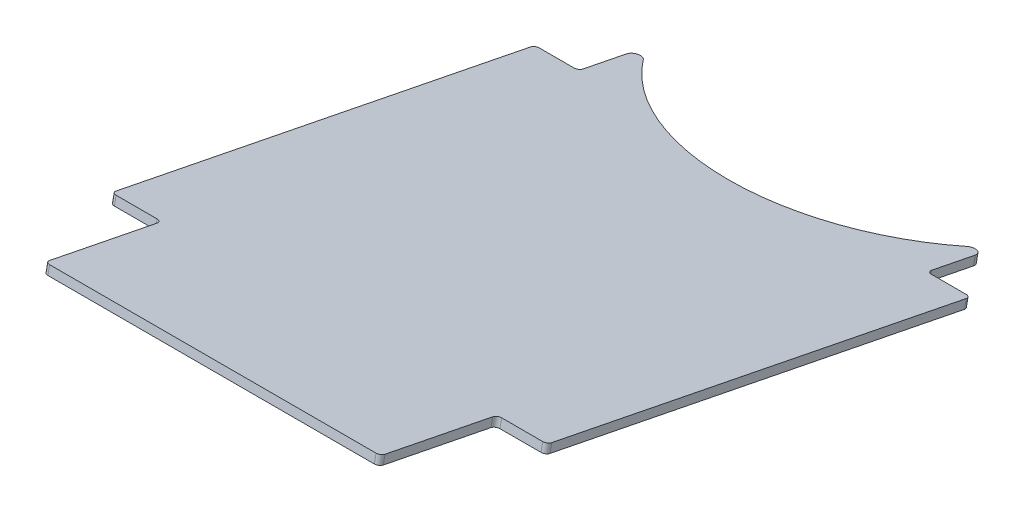
ISO-10303-21;
HEADER;
FILE_DESCRIPTION(('STEP AP214'),'2;1');
FILE_NAME('part.step','',(''),(''),'','','');
FILE_SCHEMA(('AUTOMOTIVE_DESIGN { 1 0 10303 214 1 1 1 1 }'));
ENDSEC;
DATA;
#1=APPLICATION_CONTEXT('core data for automotive mechanical design processes');
#2=APPLICATION_PROTOCOL_DEFINITION('international standard','automotive_design',2000,#1);
#3=PRODUCT_CONTEXT('',#1,'mechanical');
#4=PRODUCT('Part','Part','',(#3));
#5=PRODUCT_RELATED_PRODUCT_CATEGORY('part','',(#4));
#6=PRODUCT_DEFINITION_FORMATION('','',#4);
#7=PRODUCT_DEFINITION_CONTEXT('part definition',#1,'design');
#8=PRODUCT_DEFINITION('design','',#6,#7);
#9=PRODUCT_DEFINITION_SHAPE('','',#8);
#10=(LENGTH_UNIT() NAMED_UNIT(*) SI_UNIT(.MILLI.,.METRE.));
#11=(NAMED_UNIT(*) PLANE_ANGLE_UNIT() SI_UNIT($,.RADIAN.));
#12=(NAMED_UNIT(*) SI_UNIT($,.STERADIAN.) SOLID_ANGLE_UNIT());
#13=UNCERTAINTY_MEASURE_WITH_UNIT(LENGTH_MEASURE(1.E-05),#10,'distance_accuracy_value','');
#14=(GEOMETRIC_REPRESENTATION_CONTEXT(3) GLOBAL_UNCERTAINTY_ASSIGNED_CONTEXT((#13)) GLOBAL_UNIT_ASSIGNED_CONTEXT((#10,
#11,#12)) REPRESENTATION_CONTEXT('',''));
#15=CARTESIAN_POINT('',(0.,0.,0.));
#16=DIRECTION('',(0.,0.,1.));
#17=DIRECTION('',(1.,0.,0.));
#18=AXIS2_PLACEMENT_3D('',#15,#16,#17);
#19=CARTESIAN_POINT('',(317.5,38.1,0.));
#20=DIRECTION('',(0.,-0.980785280403232,0.195090322016121));
#21=DIRECTION('',(0.,-0.195090322016121,-0.980785280403232));
#22=AXIS2_PLACEMENT_3D('',#19,#20,#21);
#23=PLANE('',#22);
#24=DIRECTION('',(1.,0.,0.));
#25=VECTOR('',#24,1.);
#26=CARTESIAN_POINT('',(31.75,51.896948909235,69.3619461222421));
#27=LINE('',#26,#25);
#28=CARTESIAN_POINT('',(3.302,51.896948909235,69.3619461222421));
#29=VERTEX_POINT('',#28);
#30=CARTESIAN_POINT('',(28.448,51.896948909235,69.3619461222421));
#31=VERTEX_POINT('',#30);
#32=EDGE_CURVE('E355',#29,#31,#27,.T.);
#33=ORIENTED_EDGE('',*,*,#32,.F.);
#34=CARTESIAN_POINT('',(3.302,52.5411371525322,72.6004991181335));
#35=DIRECTION('',(0.,-0.980785280403232,0.195090322016121));
#36=DIRECTION('',(0.,-0.195090322016121,-0.980785280403232));
#37=AXIS2_PLACEMENT_3D('',#34,#35,#36);
#38=CIRCLE('',#37,3.302);
#39=CARTESIAN_POINT('',(0.,52.5411371525322,72.6004991181335));
#40=VERTEX_POINT('',#39);
#41=EDGE_CURVE('E295',#29,#40,#38,.F.);
#42=ORIENTED_EDGE('',*,*,#41,.T.);
#43=DIRECTION('',(0.,0.195090322016121,0.980785280403232));
#44=VECTOR('',#43,1.);
#45=CARTESIAN_POINT('',(0.,38.1,0.));
#46=LINE('',#45,#44);
#47=CARTESIAN_POINT('',(0.,112.622011955949,374.647453738828));
#48=VERTEX_POINT('',#47);
#49=EDGE_CURVE('E235',#40,#48,#46,.T.);
#50=ORIENTED_EDGE('',*,*,#49,.T.);
#51=CARTESIAN_POINT('',(3.302,112.622011955949,374.647453738828));
#52=DIRECTION('',(0.,-0.980785280403232,0.195090322016121));
#53=DIRECTION('',(0.,-0.195090322016121,-0.980785280403232));
#54=AXIS2_PLACEMENT_3D('',#51,#52,#53);
#55=CIRCLE('',#54,3.302);
#56=CARTESIAN_POINT('',(3.302,113.266200199246,377.88600673472));
#57=VERTEX_POINT('',#56);
#58=EDGE_CURVE('E292',#48,#57,#55,.F.);
#59=ORIENTED_EDGE('',*,*,#58,.T.);
#60=DIRECTION('',(-1.,0.,0.));
#61=VECTOR('',#60,1.);
#62=CARTESIAN_POINT('',(0.,113.266200199246,377.88600673472));
#63=LINE('',#62,#61);
#64=CARTESIAN_POINT('',(33.2105,113.266200199246,377.88600673472));
#65=VERTEX_POINT('',#64);
#66=EDGE_CURVE('E366',#65,#57,#63,.T.);
#67=ORIENTED_EDGE('',*,*,#66,.F.);
#68=CARTESIAN_POINT('',(33.2105,113.910388442543,381.124559730611));
#69=DIRECTION('',(0.,-0.980785280403232,0.195090322016121));
#70=DIRECTION('',(0.,-0.195090322016121,-0.980785280403232));
#71=AXIS2_PLACEMENT_3D('',#68,#69,#70);
#72=CIRCLE('',#71,3.302);
#73=CARTESIAN_POINT('',(36.5125,113.910388442543,381.124559730611));
#74=VERTEX_POINT('',#73);
#75=EDGE_CURVE('E340',#65,#74,#72,.T.);
#76=ORIENTED_EDGE('',*,*,#75,.T.);
#77=DIRECTION('',(0.,-0.195090322016121,-0.980785280403232));
#78=VECTOR('',#77,1.);
#79=CARTESIAN_POINT('',(36.5125,113.266200199246,377.88600673472));
#80=LINE('',#79,#78);
#81=CARTESIAN_POINT('',(36.5125,129.516019727189,459.579366187472));
#82=VERTEX_POINT('',#81);
#83=EDGE_CURVE('E426',#82,#74,#80,.T.);
#84=ORIENTED_EDGE('',*,*,#83,.F.);
#85=CARTESIAN_POINT('',(39.8145,129.516019727189,459.579366187472));
#86=DIRECTION('',(0.,-0.980785280403232,0.195090322016121));
#87=DIRECTION('',(0.,-0.195090322016121,-0.980785280403232));
#88=AXIS2_PLACEMENT_3D('',#85,#86,#87);
#89=CIRCLE('',#88,3.302);
#90=CARTESIAN_POINT('',(39.8145,130.160207970487,462.817919183363));
#91=VERTEX_POINT('',#90);
#92=EDGE_CURVE('E289',#82,#91,#89,.F.);
#93=ORIENTED_EDGE('',*,*,#92,.T.);
#94=DIRECTION('',(1.,0.,0.));
#95=VECTOR('',#94,1.);
#96=CARTESIAN_POINT('',(36.5125,130.160207970487,462.817919183363));
#97=LINE('',#96,#95);
#98=CARTESIAN_POINT('',(277.6855,130.160207970487,462.817919183363));
#99=VERTEX_POINT('',#98);
#100=EDGE_CURVE('E416',#91,#99,#97,.T.);
#101=ORIENTED_EDGE('',*,*,#100,.T.);
#102=CARTESIAN_POINT('',(277.6855,129.516019727189,459.579366187472));
#103=DIRECTION('',(0.,-0.980785280403232,0.195090322016121));
#104=DIRECTION('',(0.,-0.195090322016121,-0.980785280403232));
#105=AXIS2_PLACEMENT_3D('',#102,#103,#104);
#106=CIRCLE('',#105,3.302);
#107=CARTESIAN_POINT('',(280.9875,129.51601972719,459.579366187472));
#108=VERTEX_POINT('',#107);
#109=EDGE_CURVE('E287',#99,#108,#106,.F.);
#110=ORIENTED_EDGE('',*,*,#109,.T.);
#111=DIRECTION('',(0.,0.195090322016122,0.980785280403232));
#112=VECTOR('',#111,1.);
#113=CARTESIAN_POINT('',(280.9875,113.266200199246,377.88600673472));
#114=LINE('',#113,#112);
#115=CARTESIAN_POINT('',(280.9875,113.910388442543,381.124559730611));
#116=VERTEX_POINT('',#115);
#117=EDGE_CURVE('E411',#116,#108,#114,.T.);
#118=ORIENTED_EDGE('',*,*,#117,.F.);
#119=CARTESIAN_POINT('',(284.2895,113.910388442543,381.124559730611));
#120=DIRECTION('',(0.,-0.980785280403232,0.195090322016121));
#121=DIRECTION('',(0.,-0.195090322016121,-0.980785280403232));
#122=AXIS2_PLACEMENT_3D('',#119,#120,#121);
#123=CIRCLE('',#122,3.302);
#124=CARTESIAN_POINT('',(284.2895,113.266200199246,377.88600673472));
#125=VERTEX_POINT('',#124);
#126=EDGE_CURVE('E346',#116,#125,#123,.T.);
#127=ORIENTED_EDGE('',*,*,#126,.T.);
#128=DIRECTION('',(-1.,0.,0.));
#129=VECTOR('',#128,1.);
#130=CARTESIAN_POINT('',(317.5,113.266200199246,377.88600673472));
#131=LINE('',#130,#129);
#132=CARTESIAN_POINT('',(314.198,113.266200199246,377.88600673472));
#133=VERTEX_POINT('',#132);
#134=EDGE_CURVE('E410',#133,#125,#131,.T.);
#135=ORIENTED_EDGE('',*,*,#134,.F.);
#136=CARTESIAN_POINT('',(314.198,112.622011955949,374.647453738828));
#137=DIRECTION('',(0.,-0.980785280403232,0.195090322016121));
#138=DIRECTION('',(0.,-0.195090322016121,-0.980785280403232));
#139=AXIS2_PLACEMENT_3D('',#136,#137,#138);
#140=CIRCLE('',#139,3.302);
#141=CARTESIAN_POINT('',(317.5,112.622011955949,374.647453738828));
#142=VERTEX_POINT('',#141);
#143=EDGE_CURVE('E285',#133,#142,#140,.F.);
#144=ORIENTED_EDGE('',*,*,#143,.T.);
#145=DIRECTION('',(0.,0.195090322016121,0.980785280403232));
#146=VECTOR('',#145,1.);
#147=CARTESIAN_POINT('',(317.5,38.1,0.));
#148=LINE('',#147,#146);
#149=CARTESIAN_POINT('',(317.5,52.5411371525322,72.6004991181335));
#150=VERTEX_POINT('',#149);
#151=EDGE_CURVE('E382',#150,#142,#148,.T.);
#152=ORIENTED_EDGE('',*,*,#151,.F.);
#153=CARTESIAN_POINT('',(314.198,52.5411371525322,72.6004991181335));
#154=DIRECTION('',(0.,-0.980785280403232,0.195090322016121));
#155=DIRECTION('',(0.,-0.195090322016121,-0.980785280403232));
#156=AXIS2_PLACEMENT_3D('',#153,#154,#155);
#157=CIRCLE('',#156,3.302);
#158=CARTESIAN_POINT('',(314.198,51.896948909235,69.361946122242));
#159=VERTEX_POINT('',#158);
#160=EDGE_CURVE('E53',#150,#159,#157,.F.);
#161=ORIENTED_EDGE('',*,*,#160,.T.);
#162=DIRECTION('',(1.,0.,0.));
#163=VECTOR('',#162,1.);
#164=CARTESIAN_POINT('',(285.75,51.896948909235,69.3619461222421));
#165=LINE('',#164,#163);
#166=CARTESIAN_POINT('',(289.052,51.896948909235,69.3619461222421));
#167=VERTEX_POINT('',#166);
#168=EDGE_CURVE('E430',#167,#159,#165,.T.);
#169=ORIENTED_EDGE('',*,*,#168,.F.);
#170=CARTESIAN_POINT('',(289.052,51.2527606659377,66.1233931263506));
#171=DIRECTION('',(0.,-0.980785280403232,0.195090322016121));
#172=DIRECTION('',(0.,-0.195090322016121,-0.980785280403232));
#173=AXIS2_PLACEMENT_3D('',#170,#171,#172);
#174=CIRCLE('',#173,3.302);
#175=CARTESIAN_POINT('',(285.75,51.2527606659378,66.1233931263506));
#176=VERTEX_POINT('',#175);
#177=EDGE_CURVE('E61',#167,#176,#174,.T.);
#178=ORIENTED_EDGE('',*,*,#177,.T.);
#179=DIRECTION('',(0.,0.195090322016122,0.980785280403232));
#180=VECTOR('',#179,1.);
#181=CARTESIAN_POINT('',(285.75,38.1,0.));
#182=LINE('',#181,#180);
#183=CARTESIAN_POINT('',(285.75,44.922985203387,34.301462967179));
#184=VERTEX_POINT('',#183);
#185=EDGE_CURVE('E418',#184,#176,#182,.T.);
#186=ORIENTED_EDGE('',*,*,#185,.F.);
#187=CARTESIAN_POINT('',(280.67,44.922985203387,34.301462967179));
#188=DIRECTION('',(0.,-0.980785280403232,0.195090322016121));
#189=DIRECTION('',(0.,-0.195090322016121,-0.980785280403232));
#190=AXIS2_PLACEMENT_3D('',#187,#188,#189);
#191=CIRCLE('',#190,5.08);
#192=CARTESIAN_POINT('',(276.685982176012,44.3080946136842,31.2101992222294));
#193=VERTEX_POINT('',#192);
#194=EDGE_CURVE('E239',#184,#193,#191,.F.);
#195=ORIENTED_EDGE('',*,*,#194,.T.);
#196=CARTESIAN_POINT('',(158.75,26.105935679868,-60.2982332276995));
#197=DIRECTION('',(0.,-0.980785280403232,0.195090322016121));
#198=DIRECTION('',(0.,-0.195090322016121,-0.980785280403232));
#199=AXIS2_PLACEMENT_3D('',#196,#197,#198);
#200=CIRCLE('',#199,150.379545454545);
#201=CARTESIAN_POINT('',(40.8140178239881,44.3080946136842,31.2101992222294));
#202=VERTEX_POINT('',#201);
#203=EDGE_CURVE('E458',#193,#202,#200,.T.);
#204=ORIENTED_EDGE('',*,*,#203,.T.);
#205=CARTESIAN_POINT('',(36.83,44.922985203387,34.301462967179));
#206=DIRECTION('',(0.,-0.980785280403232,0.195090322016121));
#207=DIRECTION('',(0.,-0.195090322016121,-0.980785280403232));
#208=AXIS2_PLACEMENT_3D('',#205,#206,#207);
#209=CIRCLE('',#208,5.08);
#210=CARTESIAN_POINT('',(31.75,44.922985203387,34.301462967179));
#211=VERTEX_POINT('',#210);
#212=EDGE_CURVE('E240',#202,#211,#209,.F.);
#213=ORIENTED_EDGE('',*,*,#212,.T.);
#214=DIRECTION('',(0.,-0.195090322016122,-0.980785280403232));
#215=VECTOR('',#214,1.);
#216=CARTESIAN_POINT('',(31.7499999999999,38.1,0.));
#217=LINE('',#216,#215);
#218=CARTESIAN_POINT('',(31.75,51.2527606659378,66.1233931263506));
#219=VERTEX_POINT('',#218);
#220=EDGE_CURVE('E357',#219,#211,#217,.T.);
#221=ORIENTED_EDGE('',*,*,#220,.F.);
#222=CARTESIAN_POINT('',(28.448,51.2527606659377,66.1233931263506));
#223=DIRECTION('',(0.,-0.980785280403232,0.195090322016121));
#224=DIRECTION('',(0.,-0.195090322016121,-0.980785280403232));
#225=AXIS2_PLACEMENT_3D('',#222,#223,#224);
#226=CIRCLE('',#225,3.302);
#227=EDGE_CURVE('E46',#219,#31,#226,.T.);
#228=ORIENTED_EDGE('',*,*,#227,.T.);
#229=EDGE_LOOP('',(#33,#42,#50,#59,#67,#76,#84,#93,#101,#110,#118,#127,#135,#144,#152,#161,#169,
#178,#186,#195,#204,#213,#221,#228));
#230=FACE_BOUND('',#229,.T.);
#231=ADVANCED_FACE('F38',(#230),#23,.F.);
#232=CARTESIAN_POINT('',(317.5,31.8720134694395,1.23882354480237));
#233=DIRECTION('',(0.,0.980785280403232,-0.195090322016121));
#234=DIRECTION('',(0.,0.195090322016121,0.980785280403232));
#235=AXIS2_PLACEMENT_3D('',#232,#233,#234);
#236=PLANE('',#235);
#237=DIRECTION('',(0.,-0.195090322016121,-0.980785280403232));
#238=VECTOR('',#237,1.);
#239=CARTESIAN_POINT('',(0.,31.8720134694395,1.23882354480237));
#240=LINE('',#239,#238);
#241=CARTESIAN_POINT('',(0.,106.394025425388,375.886277283631));
#242=VERTEX_POINT('',#241);
#243=CARTESIAN_POINT('',(0.,46.3131506219717,73.8393226629359));
#244=VERTEX_POINT('',#243);
#245=EDGE_CURVE('E386',#242,#244,#240,.T.);
#246=ORIENTED_EDGE('',*,*,#245,.T.);
#247=CARTESIAN_POINT('',(3.302,46.3131506219717,73.8393226629359));
#248=DIRECTION('',(0.,0.980785280403232,-0.195090322016121));
#249=DIRECTION('',(0.,0.195090322016121,0.980785280403232));
#250=AXIS2_PLACEMENT_3D('',#247,#248,#249);
#251=CIRCLE('',#250,3.302);
#252=CARTESIAN_POINT('',(3.30200000000003,45.6689623786744,70.6007696670445));
#253=VERTEX_POINT('',#252);
#254=EDGE_CURVE('E278',#244,#253,#251,.F.);
#255=ORIENTED_EDGE('',*,*,#254,.T.);
#256=DIRECTION('',(1.,0.,0.));
#257=VECTOR('',#256,1.);
#258=CARTESIAN_POINT('',(317.5,45.6689623786745,70.6007696670446));
#259=LINE('',#258,#257);
#260=CARTESIAN_POINT('',(28.448,45.6689623786744,70.6007696670445));
#261=VERTEX_POINT('',#260);
#262=EDGE_CURVE('E371',#253,#261,#259,.T.);
#263=ORIENTED_EDGE('',*,*,#262,.T.);
#264=CARTESIAN_POINT('',(28.448,45.0247741353772,67.362216671153));
#265=DIRECTION('',(0.,0.980785280403232,-0.195090322016121));
#266=DIRECTION('',(0.,0.195090322016121,0.980785280403232));
#267=AXIS2_PLACEMENT_3D('',#264,#265,#266);
#268=CIRCLE('',#267,3.302);
#269=CARTESIAN_POINT('',(31.75,45.0247741353772,67.362216671153));
#270=VERTEX_POINT('',#269);
#271=EDGE_CURVE('E11',#261,#270,#268,.T.);
#272=ORIENTED_EDGE('',*,*,#271,.T.);
#273=DIRECTION('',(0.,-0.195090322016121,-0.980785280403232));
#274=VECTOR('',#273,1.);
#275=CARTESIAN_POINT('',(31.7499999999999,31.8720134694395,1.23882354480243));
#276=LINE('',#275,#274);
#277=CARTESIAN_POINT('',(31.75,38.6949986728265,35.5402865119814));
#278=VERTEX_POINT('',#277);
#279=EDGE_CURVE('E236',#270,#278,#276,.T.);
#280=ORIENTED_EDGE('',*,*,#279,.T.);
#281=CARTESIAN_POINT('',(36.83,38.6949986728265,35.5402865119814));
#282=DIRECTION('',(0.,0.980785280403232,-0.195090322016121));
#283=DIRECTION('',(0.,0.195090322016121,0.980785280403232));
#284=AXIS2_PLACEMENT_3D('',#281,#282,#283);
#285=CIRCLE('',#284,5.08);
#286=CARTESIAN_POINT('',(40.8140178239881,38.0801080831237,32.4490227670318));
#287=VERTEX_POINT('',#286);
#288=EDGE_CURVE('E226',#278,#287,#285,.F.);
#289=ORIENTED_EDGE('',*,*,#288,.T.);
#290=CARTESIAN_POINT('',(158.75,19.8779491493075,-59.0594096828972));
#291=DIRECTION('',(0.,-0.980785280403232,0.195090322016122));
#292=DIRECTION('',(0.,0.195090322016122,0.980785280403232));
#293=AXIS2_PLACEMENT_3D('',#290,#291,#292);
#294=CIRCLE('',#293,150.379545454545);
#295=CARTESIAN_POINT('',(276.685982176012,38.0801080831237,32.4490227670317));
#296=VERTEX_POINT('',#295);
#297=EDGE_CURVE('E221',#296,#287,#294,.T.);
#298=ORIENTED_EDGE('',*,*,#297,.F.);
#299=CARTESIAN_POINT('',(280.67,38.6949986728265,35.5402865119813));
#300=DIRECTION('',(0.,0.980785280403232,-0.195090322016121));
#301=DIRECTION('',(0.,0.195090322016121,0.980785280403232));
#302=AXIS2_PLACEMENT_3D('',#299,#300,#301);
#303=CIRCLE('',#302,5.08);
#304=CARTESIAN_POINT('',(285.75,38.6949986728265,35.5402865119814));
#305=VERTEX_POINT('',#304);
#306=EDGE_CURVE('E214',#296,#305,#303,.F.);
#307=ORIENTED_EDGE('',*,*,#306,.T.);
#308=DIRECTION('',(0.,0.195090322016121,0.980785280403232));
#309=VECTOR('',#308,1.);
#310=CARTESIAN_POINT('',(285.75,31.8720134694395,1.23882354480237));
#311=LINE('',#310,#309);
#312=CARTESIAN_POINT('',(285.75,45.0247741353772,67.362216671153));
#313=VERTEX_POINT('',#312);
#314=EDGE_CURVE('E218',#305,#313,#311,.T.);
#315=ORIENTED_EDGE('',*,*,#314,.T.);
#316=CARTESIAN_POINT('',(289.052,45.0247741353772,67.362216671153));
#317=DIRECTION('',(0.,0.980785280403232,-0.195090322016121));
#318=DIRECTION('',(0.,0.195090322016121,0.980785280403232));
#319=AXIS2_PLACEMENT_3D('',#316,#317,#318);
#320=CIRCLE('',#319,3.302);
#321=CARTESIAN_POINT('',(289.052,45.6689623786744,70.6007696670444));
#322=VERTEX_POINT('',#321);
#323=EDGE_CURVE('E351',#313,#322,#320,.T.);
#324=ORIENTED_EDGE('',*,*,#323,.T.);
#325=DIRECTION('',(1.,0.,0.));
#326=VECTOR('',#325,1.);
#327=CARTESIAN_POINT('',(317.5,45.6689623786744,70.6007696670444));
#328=LINE('',#327,#326);
#329=CARTESIAN_POINT('',(314.198,45.6689623786744,70.6007696670444));
#330=VERTEX_POINT('',#329);
#331=EDGE_CURVE('E375',#322,#330,#328,.T.);
#332=ORIENTED_EDGE('',*,*,#331,.T.);
#333=CARTESIAN_POINT('',(314.198,46.3131506219717,73.8393226629359));
#334=DIRECTION('',(0.,0.980785280403232,-0.195090322016121));
#335=DIRECTION('',(0.,0.195090322016121,0.980785280403232));
#336=AXIS2_PLACEMENT_3D('',#333,#334,#335);
#337=CIRCLE('',#336,3.302);
#338=CARTESIAN_POINT('',(317.5,46.3131506219717,73.8393226629359));
#339=VERTEX_POINT('',#338);
#340=EDGE_CURVE('E266',#330,#339,#337,.F.);
#341=ORIENTED_EDGE('',*,*,#340,.T.);
#342=DIRECTION('',(0.,-0.195090322016121,-0.980785280403232));
#343=VECTOR('',#342,1.);
#344=CARTESIAN_POINT('',(317.5,31.8720134694395,1.23882354480237));
#345=LINE('',#344,#343);
#346=CARTESIAN_POINT('',(317.5,106.394025425388,375.886277283631));
#347=VERTEX_POINT('',#346);
#348=EDGE_CURVE('E385',#347,#339,#345,.T.);
#349=ORIENTED_EDGE('',*,*,#348,.F.);
#350=CARTESIAN_POINT('',(314.198,106.394025425388,375.886277283631));
#351=DIRECTION('',(0.,0.980785280403232,-0.195090322016121));
#352=DIRECTION('',(0.,0.195090322016121,0.980785280403232));
#353=AXIS2_PLACEMENT_3D('',#350,#351,#352);
#354=CIRCLE('',#353,3.302);
#355=CARTESIAN_POINT('',(314.198,107.038213668685,379.124830279522));
#356=VERTEX_POINT('',#355);
#357=EDGE_CURVE('E268',#347,#356,#354,.F.);
#358=ORIENTED_EDGE('',*,*,#357,.T.);
#359=DIRECTION('',(-1.,0.,0.));
#360=VECTOR('',#359,1.);
#361=CARTESIAN_POINT('',(317.5,107.038213668685,379.124830279522));
#362=LINE('',#361,#360);
#363=CARTESIAN_POINT('',(284.2895,107.038213668685,379.124830279522));
#364=VERTEX_POINT('',#363);
#365=EDGE_CURVE('E378',#356,#364,#362,.T.);
#366=ORIENTED_EDGE('',*,*,#365,.T.);
#367=CARTESIAN_POINT('',(284.2895,107.682401911982,382.363383275414));
#368=DIRECTION('',(0.,0.980785280403232,-0.195090322016121));
#369=DIRECTION('',(0.,0.195090322016121,0.980785280403232));
#370=AXIS2_PLACEMENT_3D('',#367,#368,#369);
#371=CIRCLE('',#370,3.302);
#372=CARTESIAN_POINT('',(280.9875,107.682401911982,382.363383275414));
#373=VERTEX_POINT('',#372);
#374=EDGE_CURVE('E348',#364,#373,#371,.T.);
#375=ORIENTED_EDGE('',*,*,#374,.T.);
#376=DIRECTION('',(0.,0.195090322016121,0.980785280403232));
#377=VECTOR('',#376,1.);
#378=CARTESIAN_POINT('',(280.987499999999,31.8720134694395,1.23882354480241));
#379=LINE('',#378,#377);
#380=CARTESIAN_POINT('',(280.9875,123.288033196629,460.818189732274));
#381=VERTEX_POINT('',#380);
#382=EDGE_CURVE('E247',#373,#381,#379,.T.);
#383=ORIENTED_EDGE('',*,*,#382,.T.);
#384=CARTESIAN_POINT('',(277.6855,123.288033196629,460.818189732274));
#385=DIRECTION('',(0.,0.980785280403232,-0.195090322016121));
#386=DIRECTION('',(0.,0.195090322016121,0.980785280403232));
#387=AXIS2_PLACEMENT_3D('',#384,#385,#386);
#388=CIRCLE('',#387,3.302);
#389=CARTESIAN_POINT('',(277.6855,123.932221439926,464.056742728166));
#390=VERTEX_POINT('',#389);
#391=EDGE_CURVE('E270',#381,#390,#388,.F.);
#392=ORIENTED_EDGE('',*,*,#391,.T.);
#393=DIRECTION('',(-1.,0.,0.));
#394=VECTOR('',#393,1.);
#395=CARTESIAN_POINT('',(36.5125,123.932221439926,464.056742728166));
#396=LINE('',#395,#394);
#397=CARTESIAN_POINT('',(39.8145,123.932221439926,464.056742728166));
#398=VERTEX_POINT('',#397);
#399=EDGE_CURVE('E422',#390,#398,#396,.T.);
#400=ORIENTED_EDGE('',*,*,#399,.T.);
#401=CARTESIAN_POINT('',(39.8145,123.288033196629,460.818189732274));
#402=DIRECTION('',(0.,0.980785280403232,-0.195090322016121));
#403=DIRECTION('',(0.,0.195090322016121,0.980785280403232));
#404=AXIS2_PLACEMENT_3D('',#401,#402,#403);
#405=CIRCLE('',#404,3.302);
#406=CARTESIAN_POINT('',(36.5125,123.288033196629,460.818189732274));
#407=VERTEX_POINT('',#406);
#408=EDGE_CURVE('E272',#398,#407,#405,.F.);
#409=ORIENTED_EDGE('',*,*,#408,.T.);
#410=DIRECTION('',(0.,-0.195090322016121,-0.980785280403232));
#411=VECTOR('',#410,1.);
#412=CARTESIAN_POINT('',(36.5125,31.8720134694395,1.23882354480237));
#413=LINE('',#412,#411);
#414=CARTESIAN_POINT('',(36.5125,107.682401911982,382.363383275414));
#415=VERTEX_POINT('',#414);
#416=EDGE_CURVE('E241',#407,#415,#413,.T.);
#417=ORIENTED_EDGE('',*,*,#416,.T.);
#418=CARTESIAN_POINT('',(33.2105,107.682401911982,382.363383275414));
#419=DIRECTION('',(0.,0.980785280403232,-0.195090322016121));
#420=DIRECTION('',(0.,0.195090322016121,0.980785280403232));
#421=AXIS2_PLACEMENT_3D('',#418,#419,#420);
#422=CIRCLE('',#421,3.302);
#423=CARTESIAN_POINT('',(33.2105,107.038213668685,379.124830279522));
#424=VERTEX_POINT('',#423);
#425=EDGE_CURVE('E343',#415,#424,#422,.T.);
#426=ORIENTED_EDGE('',*,*,#425,.T.);
#427=DIRECTION('',(-1.,0.,0.));
#428=VECTOR('',#427,1.);
#429=CARTESIAN_POINT('',(317.5,107.038213668685,379.124830279522));
#430=LINE('',#429,#428);
#431=CARTESIAN_POINT('',(3.30200000000003,107.038213668685,379.124830279522));
#432=VERTEX_POINT('',#431);
#433=EDGE_CURVE('E438',#424,#432,#430,.T.);
#434=ORIENTED_EDGE('',*,*,#433,.T.);
#435=CARTESIAN_POINT('',(3.302,106.394025425388,375.886277283631));
#436=DIRECTION('',(0.,0.980785280403232,-0.195090322016121));
#437=DIRECTION('',(0.,0.195090322016121,0.980785280403232));
#438=AXIS2_PLACEMENT_3D('',#435,#436,#437);
#439=CIRCLE('',#438,3.302);
#440=EDGE_CURVE('E275',#432,#242,#439,.F.);
#441=ORIENTED_EDGE('',*,*,#440,.T.);
#442=EDGE_LOOP('',(#246,#255,#263,#272,#280,#289,#298,#307,#315,#324,#332,#341,#349,#358,#366,
#375,#383,#392,#400,#409,#417,#426,#434,#441));
#443=FACE_BOUND('',#442,.T.);
#444=ADVANCED_FACE('F217',(#443),#236,.F.);
#445=CARTESIAN_POINT('',(317.5,0.,0.));
#446=DIRECTION('',(1.,0.,0.));
#447=DIRECTION('',(0.,0.,-1.));
#448=AXIS2_PLACEMENT_3D('',#445,#446,#447);
#449=PLANE('',#448);
#450=ORIENTED_EDGE('',*,*,#151,.T.);
#451=DIRECTION('',(0.,0.980785280403232,-0.195090322016121));
#452=VECTOR('',#451,1.);
#453=CARTESIAN_POINT('',(317.5,106.394025425388,375.886277283631));
#454=LINE('',#453,#452);
#455=EDGE_CURVE('E329',#142,#347,#454,.F.);
#456=ORIENTED_EDGE('',*,*,#455,.T.);
#457=ORIENTED_EDGE('',*,*,#348,.T.);
#458=DIRECTION('',(0.,-0.980785280403232,0.195090322016121));
#459=VECTOR('',#458,1.);
#460=CARTESIAN_POINT('',(317.5,52.5411371525322,72.6004991181335));
#461=LINE('',#460,#459);
#462=EDGE_CURVE('E327',#339,#150,#461,.F.);
#463=ORIENTED_EDGE('',*,*,#462,.T.);
#464=EDGE_LOOP('',(#450,#456,#457,#463));
#465=FACE_BOUND('',#464,.T.);
#466=ADVANCED_FACE('F447',(#465),#449,.T.);
#467=CARTESIAN_POINT('',(0.,0.,0.));
#468=DIRECTION('',(1.,0.,0.));
#469=DIRECTION('',(0.,0.,-1.));
#470=AXIS2_PLACEMENT_3D('',#467,#468,#469);
#471=PLANE('',#470);
#472=ORIENTED_EDGE('',*,*,#49,.F.);
#473=DIRECTION('',(0.,-0.980785280403232,0.195090322016121));
#474=VECTOR('',#473,1.);
#475=CARTESIAN_POINT('',(0.,15.8912320581921,79.8906185046882));
#476=LINE('',#475,#474);
#477=EDGE_CURVE('E263',#40,#244,#476,.T.);
#478=ORIENTED_EDGE('',*,*,#477,.T.);
#479=ORIENTED_EDGE('',*,*,#245,.F.);
#480=DIRECTION('',(0.,0.980785280403232,-0.195090322016121));
#481=VECTOR('',#480,1.);
#482=CARTESIAN_POINT('',(0.,75.9721068616084,381.937573125383));
#483=LINE('',#482,#481);
#484=EDGE_CURVE('E259',#242,#48,#483,.T.);
#485=ORIENTED_EDGE('',*,*,#484,.T.);
#486=EDGE_LOOP('',(#472,#478,#479,#485));
#487=FACE_BOUND('',#486,.T.);
#488=ADVANCED_FACE('F486',(#487),#471,.F.);
#489=CARTESIAN_POINT('',(31.7499999999999,-49.5343196804215,17.4315499913378));
#490=DIRECTION('',(1.,0.,0.));
#491=DIRECTION('',(0.,0.,-1.));
#492=AXIS2_PLACEMENT_3D('',#489,#490,#491);
#493=PLANE('',#492);
#494=ORIENTED_EDGE('',*,*,#279,.F.);
#495=DIRECTION('',(0.,0.980785280403232,-0.195090322016121));
#496=VECTOR('',#495,1.);
#497=CARTESIAN_POINT('',(31.75,51.2527606659378,66.1233931263506));
#498=LINE('',#497,#496);
#499=EDGE_CURVE('E337',#270,#219,#498,.T.);
#500=ORIENTED_EDGE('',*,*,#499,.T.);
#501=ORIENTED_EDGE('',*,*,#220,.T.);
#502=DIRECTION('',(0.,-0.980785280403232,0.195090322016122));
#503=VECTOR('',#502,1.);
#504=CARTESIAN_POINT('',(31.75,-42.7113344770345,51.7330129585168));
#505=LINE('',#504,#503);
#506=EDGE_CURVE('E225',#211,#278,#505,.T.);
#507=ORIENTED_EDGE('',*,*,#506,.T.);
#508=EDGE_LOOP('',(#494,#500,#501,#507));
#509=FACE_BOUND('',#508,.T.);
#510=ADVANCED_FACE('F373',(#509),#493,.F.);
#511=CARTESIAN_POINT('',(31.75,-35.7373707711866,86.7934961135799));
#512=DIRECTION('',(0.,0.195090322016121,0.980785280403232));
#513=DIRECTION('',(0.,-0.980785280403232,0.195090322016121));
#514=AXIS2_PLACEMENT_3D('',#511,#512,#513);
#515=PLANE('',#514);
#516=ORIENTED_EDGE('',*,*,#262,.F.);
#517=DIRECTION('',(0.,-0.980785280403232,0.195090322016121));
#518=VECTOR('',#517,1.);
#519=CARTESIAN_POINT('',(3.302,-35.7373707711866,86.7934961135798));
#520=LINE('',#519,#518);
#521=EDGE_CURVE('E282',#253,#29,#520,.F.);
#522=ORIENTED_EDGE('',*,*,#521,.T.);
#523=ORIENTED_EDGE('',*,*,#32,.T.);
#524=DIRECTION('',(0.,0.980785280403232,-0.195090322016121));
#525=VECTOR('',#524,1.);
#526=CARTESIAN_POINT('',(28.448,45.6689623786745,70.6007696670445));
#527=LINE('',#526,#525);
#528=EDGE_CURVE('E280',#31,#261,#527,.F.);
#529=ORIENTED_EDGE('',*,*,#528,.T.);
#530=EDGE_LOOP('',(#516,#522,#523,#529));
#531=FACE_BOUND('',#530,.T.);
#532=ADVANCED_FACE('F363',(#531),#515,.F.);
#533=CARTESIAN_POINT('',(36.5125,25.6318805188243,395.317556726058));
#534=DIRECTION('',(1.,0.,0.));
#535=DIRECTION('',(0.,0.,-1.));
#536=AXIS2_PLACEMENT_3D('',#533,#534,#535);
#537=PLANE('',#536);
#538=ORIENTED_EDGE('',*,*,#416,.F.);
#539=DIRECTION('',(0.,-0.980785280403232,0.195090322016122));
#540=VECTOR('',#539,1.);
#541=CARTESIAN_POINT('',(36.5125,129.516019727189,459.579366187472));
#542=LINE('',#541,#540);
#543=EDGE_CURVE('E313',#407,#82,#542,.F.);
#544=ORIENTED_EDGE('',*,*,#543,.T.);
#545=ORIENTED_EDGE('',*,*,#83,.T.);
#546=DIRECTION('',(0.,0.980785280403232,-0.195090322016121));
#547=VECTOR('',#546,1.);
#548=CARTESIAN_POINT('',(36.5125,107.682401911982,382.363383275414));
#549=LINE('',#548,#547);
#550=EDGE_CURVE('E310',#74,#415,#549,.F.);
#551=ORIENTED_EDGE('',*,*,#550,.T.);
#552=EDGE_LOOP('',(#538,#544,#545,#551));
#553=FACE_BOUND('',#552,.T.);
#554=ADVANCED_FACE('F494',(#553),#537,.F.);
#555=CARTESIAN_POINT('',(0.,25.6318805188243,395.317556726058));
#556=DIRECTION('',(0.,-0.195090322016121,-0.980785280403232));
#557=DIRECTION('',(0.,0.980785280403232,-0.195090322016121));
#558=AXIS2_PLACEMENT_3D('',#555,#556,#557);
#559=PLANE('',#558);
#560=ORIENTED_EDGE('',*,*,#66,.T.);
#561=DIRECTION('',(0.,0.980785280403232,-0.195090322016121));
#562=VECTOR('',#561,1.);
#563=CARTESIAN_POINT('',(3.302,25.6318805188243,395.317556726058));
#564=LINE('',#563,#562);
#565=EDGE_CURVE('E301',#57,#432,#564,.F.);
#566=ORIENTED_EDGE('',*,*,#565,.T.);
#567=ORIENTED_EDGE('',*,*,#433,.F.);
#568=DIRECTION('',(0.,0.980785280403232,-0.195090322016121));
#569=VECTOR('',#568,1.);
#570=CARTESIAN_POINT('',(33.2105,113.266200199246,377.88600673472));
#571=LINE('',#570,#569);
#572=EDGE_CURVE('E297',#424,#65,#571,.T.);
#573=ORIENTED_EDGE('',*,*,#572,.T.);
#574=EDGE_LOOP('',(#560,#566,#567,#573));
#575=FACE_BOUND('',#574,.T.);
#576=ADVANCED_FACE('F504',(#575),#559,.F.);
#577=CARTESIAN_POINT('',(280.9875,25.6318805188242,395.317556726058));
#578=DIRECTION('',(-1.,0.,0.));
#579=DIRECTION('',(0.,0.,1.));
#580=AXIS2_PLACEMENT_3D('',#577,#578,#579);
#581=PLANE('',#580);
#582=ORIENTED_EDGE('',*,*,#117,.T.);
#583=DIRECTION('',(0.,-0.980785280403232,0.195090322016122));
#584=VECTOR('',#583,1.);
#585=CARTESIAN_POINT('',(280.9875,123.288033196629,460.818189732274));
#586=LINE('',#585,#584);
#587=EDGE_CURVE('E319',#108,#381,#586,.T.);
#588=ORIENTED_EDGE('',*,*,#587,.T.);
#589=ORIENTED_EDGE('',*,*,#382,.F.);
#590=DIRECTION('',(0.,0.980785280403232,-0.195090322016121));
#591=VECTOR('',#590,1.);
#592=CARTESIAN_POINT('',(280.9875,113.910388442543,381.124559730611));
#593=LINE('',#592,#591);
#594=EDGE_CURVE('E316',#373,#116,#593,.T.);
#595=ORIENTED_EDGE('',*,*,#594,.T.);
#596=EDGE_LOOP('',(#582,#588,#589,#595));
#597=FACE_BOUND('',#596,.T.);
#598=ADVANCED_FACE('F402',(#597),#581,.F.);
#599=CARTESIAN_POINT('',(317.5,25.6318805188242,395.317556726058));
#600=DIRECTION('',(0.,-0.195090322016121,-0.980785280403232));
#601=DIRECTION('',(0.,0.980785280403232,-0.195090322016121));
#602=AXIS2_PLACEMENT_3D('',#599,#600,#601);
#603=PLANE('',#602);
#604=ORIENTED_EDGE('',*,*,#365,.F.);
#605=DIRECTION('',(0.,0.980785280403232,-0.195090322016121));
#606=VECTOR('',#605,1.);
#607=CARTESIAN_POINT('',(314.198,113.266200199246,377.88600673472));
#608=LINE('',#607,#606);
#609=EDGE_CURVE('E324',#356,#133,#608,.T.);
#610=ORIENTED_EDGE('',*,*,#609,.T.);
#611=ORIENTED_EDGE('',*,*,#134,.T.);
#612=DIRECTION('',(0.,0.980785280403232,-0.195090322016121));
#613=VECTOR('',#612,1.);
#614=CARTESIAN_POINT('',(284.2895,107.038213668685,379.124830279522));
#615=LINE('',#614,#613);
#616=EDGE_CURVE('E322',#125,#364,#615,.F.);
#617=ORIENTED_EDGE('',*,*,#616,.T.);
#618=EDGE_LOOP('',(#604,#610,#611,#617));
#619=FACE_BOUND('',#618,.T.);
#620=ADVANCED_FACE('F414',(#619),#603,.F.);
#621=CARTESIAN_POINT('',(285.75,-49.5343196804215,17.4315499913378));
#622=DIRECTION('',(-1.,0.,0.));
#623=DIRECTION('',(0.,0.,1.));
#624=AXIS2_PLACEMENT_3D('',#621,#622,#623);
#625=PLANE('',#624);
#626=ORIENTED_EDGE('',*,*,#185,.T.);
#627=DIRECTION('',(0.,0.980785280403232,-0.195090322016121));
#628=VECTOR('',#627,1.);
#629=CARTESIAN_POINT('',(285.75,45.0247741353772,67.362216671153));
#630=LINE('',#629,#628);
#631=EDGE_CURVE('E234',#176,#313,#630,.F.);
#632=ORIENTED_EDGE('',*,*,#631,.T.);
#633=ORIENTED_EDGE('',*,*,#314,.F.);
#634=DIRECTION('',(0.,-0.980785280403232,0.195090322016122));
#635=VECTOR('',#634,1.);
#636=CARTESIAN_POINT('',(285.75,-42.7113344770345,51.7330129585168));
#637=LINE('',#636,#635);
#638=EDGE_CURVE('E232',#305,#184,#637,.F.);
#639=ORIENTED_EDGE('',*,*,#638,.T.);
#640=EDGE_LOOP('',(#626,#632,#633,#639));
#641=FACE_BOUND('',#640,.T.);
#642=ADVANCED_FACE('F231',(#641),#625,.F.);
#643=CARTESIAN_POINT('',(285.75,-35.7373707711866,86.7934961135798));
#644=DIRECTION('',(0.,0.195090322016121,0.980785280403232));
#645=DIRECTION('',(0.,-0.980785280403232,0.195090322016121));
#646=AXIS2_PLACEMENT_3D('',#643,#644,#645);
#647=PLANE('',#646);
#648=ORIENTED_EDGE('',*,*,#168,.T.);
#649=DIRECTION('',(0.,-0.980785280403232,0.195090322016121));
#650=VECTOR('',#649,1.);
#651=CARTESIAN_POINT('',(314.198,45.6689623786745,70.6007696670444));
#652=LINE('',#651,#650);
#653=EDGE_CURVE('E333',#159,#330,#652,.T.);
#654=ORIENTED_EDGE('',*,*,#653,.T.);
#655=ORIENTED_EDGE('',*,*,#331,.F.);
#656=DIRECTION('',(0.,0.980785280403232,-0.195090322016121));
#657=VECTOR('',#656,1.);
#658=CARTESIAN_POINT('',(289.052,51.896948909235,69.3619461222421));
#659=LINE('',#658,#657);
#660=EDGE_CURVE('E331',#322,#167,#659,.T.);
#661=ORIENTED_EDGE('',*,*,#660,.T.);
#662=EDGE_LOOP('',(#648,#654,#655,#661));
#663=FACE_BOUND('',#662,.T.);
#664=ADVANCED_FACE('F454',(#663),#647,.F.);
#665=CARTESIAN_POINT('',(36.5125,372.83200687462,414.547497167064));
#666=DIRECTION('',(0.,0.195090322016122,0.980785280403232));
#667=DIRECTION('',(0.,-0.980785280403232,0.195090322016122));
#668=AXIS2_PLACEMENT_3D('',#665,#666,#667);
#669=PLANE('',#668);
#670=ORIENTED_EDGE('',*,*,#100,.F.);
#671=DIRECTION('',(0.,-0.980785280403232,0.195090322016122));
#672=VECTOR('',#671,1.);
#673=CARTESIAN_POINT('',(39.8145,123.932221439926,464.056742728166));
#674=LINE('',#673,#672);
#675=EDGE_CURVE('E306',#91,#398,#674,.T.);
#676=ORIENTED_EDGE('',*,*,#675,.T.);
#677=ORIENTED_EDGE('',*,*,#399,.F.);
#678=DIRECTION('',(0.,-0.980785280403232,0.195090322016122));
#679=VECTOR('',#678,1.);
#680=CARTESIAN_POINT('',(277.6855,130.160207970487,462.817919183363));
#681=LINE('',#680,#679);
#682=EDGE_CURVE('E304',#390,#99,#681,.F.);
#683=ORIENTED_EDGE('',*,*,#682,.T.);
#684=EDGE_LOOP('',(#670,#676,#677,#683));
#685=FACE_BOUND('',#684,.T.);
#686=ADVANCED_FACE('F501',(#685),#669,.T.);
#687=CARTESIAN_POINT('',(158.75,114.662310616444,-77.9131914128939));
#688=DIRECTION('',(0.,-0.980785280403232,0.195090322016122));
#689=DIRECTION('',(0.,-0.195090322016122,-0.980785280403232));
#690=AXIS2_PLACEMENT_3D('',#687,#688,#689);
#691=CYLINDRICAL_SURFACE('',#690,150.379545454545);
#692=ORIENTED_EDGE('',*,*,#203,.F.);
#693=DIRECTION('',(0.,-0.980785280403232,0.195090322016122));
#694=VECTOR('',#693,1.);
#695=CARTESIAN_POINT('',(276.685982176012,132.86446955026,13.595241037035));
#696=LINE('',#695,#694);
#697=EDGE_CURVE('E254',#193,#296,#696,.T.);
#698=ORIENTED_EDGE('',*,*,#697,.T.);
#699=ORIENTED_EDGE('',*,*,#297,.T.);
#700=DIRECTION('',(0.,-0.980785280403232,0.195090322016122));
#701=VECTOR('',#700,1.);
#702=CARTESIAN_POINT('',(40.8140178239881,132.86446955026,13.5952410370351));
#703=LINE('',#702,#701);
#704=EDGE_CURVE('E252',#287,#202,#703,.F.);
#705=ORIENTED_EDGE('',*,*,#704,.T.);
#706=EDGE_LOOP('',(#692,#698,#699,#705));
#707=FACE_BOUND('',#706,.T.);
#708=ADVANCED_FACE('F461',(#707),#691,.F.);
#709=CARTESIAN_POINT('',(280.67,133.479360139963,16.6865047819846));
#710=DIRECTION('',(0.,-0.980785280403232,0.195090322016122));
#711=DIRECTION('',(0.,-0.195090322016122,-0.980785280403232));
#712=AXIS2_PLACEMENT_3D('',#709,#710,#711);
#713=CYLINDRICAL_SURFACE('',#712,5.08);
#714=ORIENTED_EDGE('',*,*,#306,.F.);
#715=ORIENTED_EDGE('',*,*,#697,.F.);
#716=ORIENTED_EDGE('',*,*,#194,.F.);
#717=ORIENTED_EDGE('',*,*,#638,.F.);
#718=EDGE_LOOP('',(#714,#715,#716,#717));
#719=FACE_BOUND('',#718,.T.);
#720=ADVANCED_FACE('F238',(#719),#713,.T.);
#721=CARTESIAN_POINT('',(36.83,133.479360139963,16.6865047819847));
#722=DIRECTION('',(0.,-0.980785280403232,0.195090322016122));
#723=DIRECTION('',(0.,-0.195090322016122,-0.980785280403232));
#724=AXIS2_PLACEMENT_3D('',#721,#722,#723);
#725=CYLINDRICAL_SURFACE('',#724,5.08);
#726=ORIENTED_EDGE('',*,*,#212,.F.);
#727=ORIENTED_EDGE('',*,*,#704,.F.);
#728=ORIENTED_EDGE('',*,*,#288,.F.);
#729=ORIENTED_EDGE('',*,*,#506,.F.);
#730=EDGE_LOOP('',(#726,#727,#728,#729));
#731=FACE_BOUND('',#730,.T.);
#732=ADVANCED_FACE('F467',(#731),#725,.T.);
#733=CARTESIAN_POINT('',(3.302,15.8912320581921,79.8906185046883));
#734=DIRECTION('',(0.,-0.980785280403232,0.195090322016121));
#735=DIRECTION('',(0.,-0.195090322016121,-0.980785280403232));
#736=AXIS2_PLACEMENT_3D('',#733,#734,#735);
#737=CYLINDRICAL_SURFACE('',#736,3.302);
#738=ORIENTED_EDGE('',*,*,#41,.F.);
#739=ORIENTED_EDGE('',*,*,#521,.F.);
#740=ORIENTED_EDGE('',*,*,#254,.F.);
#741=ORIENTED_EDGE('',*,*,#477,.F.);
#742=EDGE_LOOP('',(#738,#739,#740,#741));
#743=FACE_BOUND('',#742,.T.);
#744=ADVANCED_FACE('F469',(#743),#737,.T.);
#745=CARTESIAN_POINT('',(3.302,75.9721068616084,381.937573125383));
#746=DIRECTION('',(0.,0.980785280403232,-0.195090322016121));
#747=DIRECTION('',(0.,0.195090322016121,0.980785280403232));
#748=AXIS2_PLACEMENT_3D('',#745,#746,#747);
#749=CYLINDRICAL_SURFACE('',#748,3.302);
#750=ORIENTED_EDGE('',*,*,#440,.F.);
#751=ORIENTED_EDGE('',*,*,#565,.F.);
#752=ORIENTED_EDGE('',*,*,#58,.F.);
#753=ORIENTED_EDGE('',*,*,#484,.F.);
#754=EDGE_LOOP('',(#750,#751,#752,#753));
#755=FACE_BOUND('',#754,.T.);
#756=ADVANCED_FACE('F475',(#755),#749,.T.);
#757=CARTESIAN_POINT('',(39.8145,372.187818631323,411.308944171172));
#758=DIRECTION('',(0.,0.980785280403232,-0.195090322016122));
#759=DIRECTION('',(0.,0.195090322016122,0.980785280403232));
#760=AXIS2_PLACEMENT_3D('',#757,#758,#759);
#761=CYLINDRICAL_SURFACE('',#760,3.302);
#762=ORIENTED_EDGE('',*,*,#92,.F.);
#763=ORIENTED_EDGE('',*,*,#543,.F.);
#764=ORIENTED_EDGE('',*,*,#408,.F.);
#765=ORIENTED_EDGE('',*,*,#675,.F.);
#766=EDGE_LOOP('',(#762,#763,#764,#765));
#767=FACE_BOUND('',#766,.T.);
#768=ADVANCED_FACE('F622',(#767),#761,.T.);
#769=CARTESIAN_POINT('',(277.6855,41.8817000467679,477.01091617881));
#770=DIRECTION('',(0.,0.980785280403232,-0.195090322016122));
#771=DIRECTION('',(0.,0.195090322016122,0.980785280403232));
#772=AXIS2_PLACEMENT_3D('',#769,#770,#771);
#773=CYLINDRICAL_SURFACE('',#772,3.302);
#774=ORIENTED_EDGE('',*,*,#109,.F.);
#775=ORIENTED_EDGE('',*,*,#682,.F.);
#776=ORIENTED_EDGE('',*,*,#391,.F.);
#777=ORIENTED_EDGE('',*,*,#587,.F.);
#778=EDGE_LOOP('',(#774,#775,#776,#777));
#779=FACE_BOUND('',#778,.T.);
#780=ADVANCED_FACE('F632',(#779),#773,.T.);
#781=CARTESIAN_POINT('',(314.198,24.987692275527,392.079003730166));
#782=DIRECTION('',(0.,-0.980785280403232,0.195090322016121));
#783=DIRECTION('',(0.,-0.195090322016121,-0.980785280403232));
#784=AXIS2_PLACEMENT_3D('',#781,#782,#783);
#785=CYLINDRICAL_SURFACE('',#784,3.302);
#786=ORIENTED_EDGE('',*,*,#357,.F.);
#787=ORIENTED_EDGE('',*,*,#455,.F.);
#788=ORIENTED_EDGE('',*,*,#143,.F.);
#789=ORIENTED_EDGE('',*,*,#609,.F.);
#790=EDGE_LOOP('',(#786,#787,#788,#789));
#791=FACE_BOUND('',#790,.T.);
#792=ADVANCED_FACE('F444',(#791),#785,.T.);
#793=CARTESIAN_POINT('',(314.198,-35.0931825278894,90.0320491094713));
#794=DIRECTION('',(0.,0.980785280403232,-0.195090322016121));
#795=DIRECTION('',(0.,0.195090322016121,0.980785280403232));
#796=AXIS2_PLACEMENT_3D('',#793,#794,#795);
#797=CYLINDRICAL_SURFACE('',#796,3.302);
#798=ORIENTED_EDGE('',*,*,#160,.F.);
#799=ORIENTED_EDGE('',*,*,#462,.F.);
#800=ORIENTED_EDGE('',*,*,#340,.F.);
#801=ORIENTED_EDGE('',*,*,#653,.F.);
#802=EDGE_LOOP('',(#798,#799,#800,#801));
#803=FACE_BOUND('',#802,.T.);
#804=ADVANCED_FACE('F450',(#803),#797,.T.);
#805=CARTESIAN_POINT('',(33.2105,26.2760687621215,398.556109721949));
#806=DIRECTION('',(0.,-0.980785280403232,0.195090322016121));
#807=DIRECTION('',(0.,-0.195090322016121,-0.980785280403232));
#808=AXIS2_PLACEMENT_3D('',#805,#806,#807);
#809=CYLINDRICAL_SURFACE('',#808,3.302);
#810=ORIENTED_EDGE('',*,*,#425,.F.);
#811=ORIENTED_EDGE('',*,*,#550,.F.);
#812=ORIENTED_EDGE('',*,*,#75,.F.);
#813=ORIENTED_EDGE('',*,*,#572,.F.);
#814=EDGE_LOOP('',(#810,#811,#812,#813));
#815=FACE_BOUND('',#814,.T.);
#816=ADVANCED_FACE('F659',(#815),#809,.F.);
#817=CARTESIAN_POINT('',(284.2895,26.2760687621215,398.556109721949));
#818=DIRECTION('',(0.,-0.980785280403232,0.195090322016121));
#819=DIRECTION('',(0.,-0.195090322016121,-0.980785280403232));
#820=AXIS2_PLACEMENT_3D('',#817,#818,#819);
#821=CYLINDRICAL_SURFACE('',#820,3.302);
#822=ORIENTED_EDGE('',*,*,#374,.F.);
#823=ORIENTED_EDGE('',*,*,#616,.F.);
#824=ORIENTED_EDGE('',*,*,#126,.F.);
#825=ORIENTED_EDGE('',*,*,#594,.F.);
#826=EDGE_LOOP('',(#822,#823,#824,#825));
#827=FACE_BOUND('',#826,.T.);
#828=ADVANCED_FACE('F406',(#827),#821,.F.);
#829=CARTESIAN_POINT('',(289.052,-36.3815590144838,83.5549431176884));
#830=DIRECTION('',(0.,-0.980785280403232,0.195090322016121));
#831=DIRECTION('',(0.,-0.195090322016121,-0.980785280403232));
#832=AXIS2_PLACEMENT_3D('',#829,#830,#831);
#833=CYLINDRICAL_SURFACE('',#832,3.302);
#834=ORIENTED_EDGE('',*,*,#323,.F.);
#835=ORIENTED_EDGE('',*,*,#631,.F.);
#836=ORIENTED_EDGE('',*,*,#177,.F.);
#837=ORIENTED_EDGE('',*,*,#660,.F.);
#838=EDGE_LOOP('',(#834,#835,#836,#837));
#839=FACE_BOUND('',#838,.T.);
#840=ADVANCED_FACE('F455',(#839),#833,.F.);
#841=CARTESIAN_POINT('',(28.448,-36.3815590144838,83.5549431176884));
#842=DIRECTION('',(0.,-0.980785280403232,0.195090322016121));
#843=DIRECTION('',(0.,-0.195090322016121,-0.980785280403232));
#844=AXIS2_PLACEMENT_3D('',#841,#842,#843);
#845=CYLINDRICAL_SURFACE('',#844,3.302);
#846=ORIENTED_EDGE('',*,*,#271,.F.);
#847=ORIENTED_EDGE('',*,*,#528,.F.);
#848=ORIENTED_EDGE('',*,*,#227,.F.);
#849=ORIENTED_EDGE('',*,*,#499,.F.);
#850=EDGE_LOOP('',(#846,#847,#848,#849));
#851=FACE_BOUND('',#850,.T.);
#852=ADVANCED_FACE('F40',(#851),#845,.F.);
#853=CLOSED_SHELL('',(#231,#444,#466,#488,#510,#532,#554,#576,#598,#620,#642,#664,#686,#708,
#720,#732,#744,#756,#768,#780,#792,#804,#816,#828,#840,#852));
#854=MANIFOLD_SOLID_BREP('B2',#853);
#855=ADVANCED_BREP_SHAPE_REPRESENTATION('',(#18,#854),#14);
#856=SHAPE_DEFINITION_REPRESENTATION(#9,#855);
ENDSEC;
END-ISO-10303-21;
